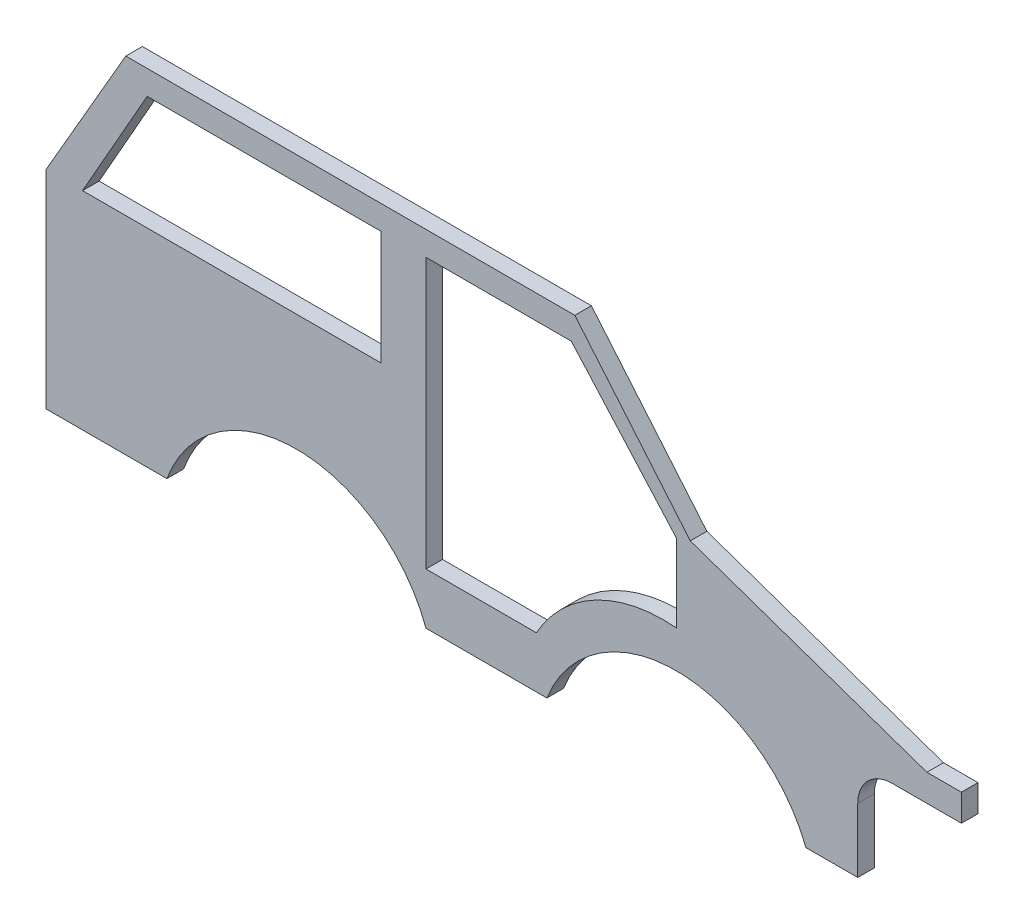
ISO-10303-21;
HEADER;
FILE_DESCRIPTION(('STEP AP214'),'2;1');
FILE_NAME('part.step','',(''),(''),'','','');
FILE_SCHEMA(('AUTOMOTIVE_DESIGN { 1 0 10303 214 1 1 1 1 }'));
ENDSEC;
DATA;
#1=APPLICATION_CONTEXT('core data for automotive mechanical design processes');
#2=APPLICATION_PROTOCOL_DEFINITION('international standard','automotive_design',2000,#1);
#3=PRODUCT_CONTEXT('',#1,'mechanical');
#4=PRODUCT('Part','Part','',(#3));
#5=PRODUCT_RELATED_PRODUCT_CATEGORY('part','',(#4));
#6=PRODUCT_DEFINITION_FORMATION('','',#4);
#7=PRODUCT_DEFINITION_CONTEXT('part definition',#1,'design');
#8=PRODUCT_DEFINITION('design','',#6,#7);
#9=PRODUCT_DEFINITION_SHAPE('','',#8);
#10=(LENGTH_UNIT() NAMED_UNIT(*) SI_UNIT(.MILLI.,.METRE.));
#11=(NAMED_UNIT(*) PLANE_ANGLE_UNIT() SI_UNIT($,.RADIAN.));
#12=(NAMED_UNIT(*) SI_UNIT($,.STERADIAN.) SOLID_ANGLE_UNIT());
#13=UNCERTAINTY_MEASURE_WITH_UNIT(LENGTH_MEASURE(1.E-05),#10,'distance_accuracy_value','');
#14=(GEOMETRIC_REPRESENTATION_CONTEXT(3) GLOBAL_UNCERTAINTY_ASSIGNED_CONTEXT((#13)) GLOBAL_UNIT_ASSIGNED_CONTEXT((#10,
#11,#12)) REPRESENTATION_CONTEXT('',''));
#15=CARTESIAN_POINT('',(0.,0.,0.));
#16=DIRECTION('',(0.,0.,1.));
#17=DIRECTION('',(1.,0.,0.));
#18=AXIS2_PLACEMENT_3D('',#15,#16,#17);
#19=CARTESIAN_POINT('',(55.,0.,4.8));
#20=DIRECTION('',(1.,0.,0.));
#21=DIRECTION('',(0.,1.,0.));
#22=AXIS2_PLACEMENT_3D('',#19,#20,#21);
#23=PLANE('',#22);
#24=DIRECTION('',(0.,-1.,0.));
#25=VECTOR('',#24,1.);
#26=CARTESIAN_POINT('',(55.,0.,0.));
#27=LINE('',#26,#25);
#28=CARTESIAN_POINT('',(55.,58.8607484875032,0.));
#29=VERTEX_POINT('',#28);
#30=CARTESIAN_POINT('',(55.,36.3212557276562,0.));
#31=VERTEX_POINT('',#30);
#32=EDGE_CURVE('E319',#29,#31,#27,.T.);
#33=ORIENTED_EDGE('',*,*,#32,.T.);
#34=DIRECTION('',(0.,0.,-1.));
#35=VECTOR('',#34,1.);
#36=CARTESIAN_POINT('',(55.,36.3212557276562,4.8));
#37=LINE('',#36,#35);
#38=CARTESIAN_POINT('',(55.,36.3212557276562,4.8));
#39=VERTEX_POINT('',#38);
#40=EDGE_CURVE('E11',#39,#31,#37,.T.);
#41=ORIENTED_EDGE('',*,*,#40,.F.);
#42=DIRECTION('',(0.,-1.,0.));
#43=VECTOR('',#42,1.);
#44=CARTESIAN_POINT('',(55.,0.,4.8));
#45=LINE('',#44,#43);
#46=CARTESIAN_POINT('',(55.,58.8607484875032,4.8));
#47=VERTEX_POINT('',#46);
#48=EDGE_CURVE('E489',#47,#39,#45,.T.);
#49=ORIENTED_EDGE('',*,*,#48,.F.);
#50=DIRECTION('',(0.,0.,-1.));
#51=VECTOR('',#50,1.);
#52=CARTESIAN_POINT('',(55.,58.8607484875032,4.8));
#53=LINE('',#52,#51);
#54=EDGE_CURVE('E338',#47,#29,#53,.T.);
#55=ORIENTED_EDGE('',*,*,#54,.T.);
#56=EDGE_LOOP('',(#33,#41,#49,#55));
#57=FACE_BOUND('',#56,.T.);
#58=ADVANCED_FACE('F43',(#57),#23,.F.);
#59=CARTESIAN_POINT('',(51.2398438065162,-5.5727573362113,4.8));
#60=DIRECTION('',(0.,0.,-1.));
#61=DIRECTION('',(-1.,0.,0.));
#62=AXIS2_PLACEMENT_3D('',#59,#60,#61);
#63=CYLINDRICAL_SURFACE('',#62,42.0624191552851);
#64=CARTESIAN_POINT('',(51.2398438065162,-5.5727573362113,0.));
#65=DIRECTION('',(0.,0.,1.));
#66=DIRECTION('',(1.,0.,0.));
#67=AXIS2_PLACEMENT_3D('',#64,#65,#66);
#68=CIRCLE('',#67,42.0624191552851);
#69=CARTESIAN_POINT('',(14.4666978922717,14.8474004683841,0.));
#70=VERTEX_POINT('',#69);
#71=EDGE_CURVE('E323',#31,#70,#68,.T.);
#72=ORIENTED_EDGE('',*,*,#71,.T.);
#73=DIRECTION('',(0.,0.,-1.));
#74=VECTOR('',#73,1.);
#75=CARTESIAN_POINT('',(14.4666978922717,14.8474004683841,4.8));
#76=LINE('',#75,#74);
#77=CARTESIAN_POINT('',(14.4666978922717,14.8474004683841,4.8));
#78=VERTEX_POINT('',#77);
#79=EDGE_CURVE('E54',#78,#70,#76,.T.);
#80=ORIENTED_EDGE('',*,*,#79,.F.);
#81=CARTESIAN_POINT('',(51.2398438065162,-5.5727573362113,4.8));
#82=DIRECTION('',(0.,0.,1.));
#83=DIRECTION('',(1.,0.,0.));
#84=AXIS2_PLACEMENT_3D('',#81,#82,#83);
#85=CIRCLE('',#84,42.0624191552851);
#86=EDGE_CURVE('E246',#39,#78,#85,.T.);
#87=ORIENTED_EDGE('',*,*,#86,.F.);
#88=ORIENTED_EDGE('',*,*,#40,.T.);
#89=EDGE_LOOP('',(#72,#80,#87,#88));
#90=FACE_BOUND('',#89,.T.);
#91=ADVANCED_FACE('F496',(#90),#63,.T.);
#92=CARTESIAN_POINT('',(0.,14.8474004683841,4.8));
#93=DIRECTION('',(0.,1.,0.));
#94=DIRECTION('',(0.,0.,1.));
#95=AXIS2_PLACEMENT_3D('',#92,#93,#94);
#96=PLANE('',#95);
#97=DIRECTION('',(1.,0.,0.));
#98=VECTOR('',#97,1.);
#99=CARTESIAN_POINT('',(0.,14.8474004683841,0.));
#100=LINE('',#99,#98);
#101=CARTESIAN_POINT('',(-17.5,14.8474004683841,0.));
#102=VERTEX_POINT('',#101);
#103=EDGE_CURVE('E327',#102,#70,#100,.T.);
#104=ORIENTED_EDGE('',*,*,#103,.F.);
#105=DIRECTION('',(0.,0.,-1.));
#106=VECTOR('',#105,1.);
#107=CARTESIAN_POINT('',(-17.5,14.8474004683841,4.8));
#108=LINE('',#107,#106);
#109=CARTESIAN_POINT('',(-17.5,14.8474004683841,4.8));
#110=VERTEX_POINT('',#109);
#111=EDGE_CURVE('E232',#110,#102,#108,.T.);
#112=ORIENTED_EDGE('',*,*,#111,.F.);
#113=DIRECTION('',(1.,0.,0.));
#114=VECTOR('',#113,1.);
#115=CARTESIAN_POINT('',(0.,14.8474004683841,4.8));
#116=LINE('',#115,#114);
#117=EDGE_CURVE('E242',#110,#78,#116,.T.);
#118=ORIENTED_EDGE('',*,*,#117,.T.);
#119=ORIENTED_EDGE('',*,*,#79,.T.);
#120=EDGE_LOOP('',(#104,#112,#118,#119));
#121=FACE_BOUND('',#120,.T.);
#122=ADVANCED_FACE('F499',(#121),#96,.T.);
#123=CARTESIAN_POINT('',(-17.5,0.,4.8));
#124=DIRECTION('',(1.,0.,0.));
#125=DIRECTION('',(0.,0.,-1.));
#126=AXIS2_PLACEMENT_3D('',#123,#124,#125);
#127=PLANE('',#126);
#128=DIRECTION('',(0.,-1.,0.));
#129=VECTOR('',#128,1.);
#130=CARTESIAN_POINT('',(-17.5,0.,0.));
#131=LINE('',#130,#129);
#132=CARTESIAN_POINT('',(-17.5,92.9990061253258,0.));
#133=VERTEX_POINT('',#132);
#134=EDGE_CURVE('E230',#133,#102,#131,.T.);
#135=ORIENTED_EDGE('',*,*,#134,.F.);
#136=DIRECTION('',(0.,0.,-1.));
#137=VECTOR('',#136,1.);
#138=CARTESIAN_POINT('',(-17.5,92.9990061253258,4.8));
#139=LINE('',#138,#137);
#140=CARTESIAN_POINT('',(-17.5,92.9990061253258,4.8));
#141=VERTEX_POINT('',#140);
#142=EDGE_CURVE('E224',#141,#133,#139,.T.);
#143=ORIENTED_EDGE('',*,*,#142,.F.);
#144=DIRECTION('',(0.,-1.,0.));
#145=VECTOR('',#144,1.);
#146=CARTESIAN_POINT('',(-17.5,0.,4.8));
#147=LINE('',#146,#145);
#148=EDGE_CURVE('E228',#141,#110,#147,.T.);
#149=ORIENTED_EDGE('',*,*,#148,.T.);
#150=ORIENTED_EDGE('',*,*,#111,.T.);
#151=EDGE_LOOP('',(#135,#143,#149,#150));
#152=FACE_BOUND('',#151,.T.);
#153=ADVANCED_FACE('F226',(#152),#127,.T.);
#154=CARTESIAN_POINT('',(0.,92.9990061253258,4.8));
#155=DIRECTION('',(0.,1.,0.));
#156=DIRECTION('',(0.,0.,1.));
#157=AXIS2_PLACEMENT_3D('',#154,#155,#156);
#158=PLANE('',#157);
#159=DIRECTION('',(1.,0.,0.));
#160=VECTOR('',#159,1.);
#161=CARTESIAN_POINT('',(0.,92.9990061253258,0.));
#162=LINE('',#161,#160);
#163=CARTESIAN_POINT('',(24.5788038979521,92.9990061253258,0.));
#164=VERTEX_POINT('',#163);
#165=EDGE_CURVE('E142',#133,#164,#162,.T.);
#166=ORIENTED_EDGE('',*,*,#165,.T.);
#167=DIRECTION('',(0.,0.,-1.));
#168=VECTOR('',#167,1.);
#169=CARTESIAN_POINT('',(24.5788038979521,92.9990061253258,4.8));
#170=LINE('',#169,#168);
#171=CARTESIAN_POINT('',(24.5788038979521,92.9990061253258,4.8));
#172=VERTEX_POINT('',#171);
#173=EDGE_CURVE('E233',#172,#164,#170,.T.);
#174=ORIENTED_EDGE('',*,*,#173,.F.);
#175=DIRECTION('',(1.,0.,0.));
#176=VECTOR('',#175,1.);
#177=CARTESIAN_POINT('',(0.,92.9990061253258,4.8));
#178=LINE('',#177,#176);
#179=EDGE_CURVE('E235',#141,#172,#178,.T.);
#180=ORIENTED_EDGE('',*,*,#179,.F.);
#181=ORIENTED_EDGE('',*,*,#142,.T.);
#182=EDGE_LOOP('',(#166,#174,#180,#181));
#183=FACE_BOUND('',#182,.T.);
#184=ADVANCED_FACE('F236',(#183),#158,.F.);
#185=CARTESIAN_POINT('',(107.5,0.,4.8));
#186=DIRECTION('',(-1.,0.,0.));
#187=DIRECTION('',(0.,-1.,0.));
#188=AXIS2_PLACEMENT_3D('',#185,#186,#187);
#189=PLANE('',#188);
#190=DIRECTION('',(0.,1.,0.));
#191=VECTOR('',#190,1.);
#192=CARTESIAN_POINT('',(107.5,0.,0.));
#193=LINE('',#192,#191);
#194=CARTESIAN_POINT('',(107.5,0.,0.));
#195=VERTEX_POINT('',#194);
#196=CARTESIAN_POINT('',(107.5,18.5999999999997,0.));
#197=VERTEX_POINT('',#196);
#198=EDGE_CURVE('E266',#195,#197,#193,.T.);
#199=ORIENTED_EDGE('',*,*,#198,.T.);
#200=DIRECTION('',(0.,0.,-1.));
#201=VECTOR('',#200,1.);
#202=CARTESIAN_POINT('',(107.5,18.5999999999997,4.8));
#203=LINE('',#202,#201);
#204=CARTESIAN_POINT('',(107.5,18.5999999999997,4.8));
#205=VERTEX_POINT('',#204);
#206=EDGE_CURVE('E341',#205,#197,#203,.T.);
#207=ORIENTED_EDGE('',*,*,#206,.F.);
#208=DIRECTION('',(0.,1.,0.));
#209=VECTOR('',#208,1.);
#210=CARTESIAN_POINT('',(107.5,0.,4.8));
#211=LINE('',#210,#209);
#212=CARTESIAN_POINT('',(107.5,0.,4.8));
#213=VERTEX_POINT('',#212);
#214=EDGE_CURVE('E431',#213,#205,#211,.T.);
#215=ORIENTED_EDGE('',*,*,#214,.F.);
#216=DIRECTION('',(0.,0.,-1.));
#217=VECTOR('',#216,1.);
#218=CARTESIAN_POINT('',(107.5,0.,4.8));
#219=LINE('',#218,#217);
#220=EDGE_CURVE('E348',#213,#195,#219,.T.);
#221=ORIENTED_EDGE('',*,*,#220,.T.);
#222=EDGE_LOOP('',(#199,#207,#215,#221));
#223=FACE_BOUND('',#222,.T.);
#224=ADVANCED_FACE('F577',(#223),#189,.F.);
#225=CARTESIAN_POINT('',(117.5,18.5999999999997,4.8));
#226=DIRECTION('',(0.,0.,-1.));
#227=DIRECTION('',(-1.,0.,0.));
#228=AXIS2_PLACEMENT_3D('',#225,#226,#227);
#229=CYLINDRICAL_SURFACE('',#228,10.);
#230=CARTESIAN_POINT('',(117.5,18.5999999999997,0.));
#231=DIRECTION('',(0.,0.,1.));
#232=DIRECTION('',(1.,0.,0.));
#233=AXIS2_PLACEMENT_3D('',#230,#231,#232);
#234=CIRCLE('',#233,10.);
#235=CARTESIAN_POINT('',(117.5,28.5999999999997,0.));
#236=VERTEX_POINT('',#235);
#237=EDGE_CURVE('E270',#197,#236,#234,.F.);
#238=ORIENTED_EDGE('',*,*,#237,.T.);
#239=DIRECTION('',(0.,0.,-1.));
#240=VECTOR('',#239,1.);
#241=CARTESIAN_POINT('',(117.5,28.5999999999997,4.8));
#242=LINE('',#241,#240);
#243=CARTESIAN_POINT('',(117.5,28.5999999999997,4.8));
#244=VERTEX_POINT('',#243);
#245=EDGE_CURVE('E393',#244,#236,#242,.T.);
#246=ORIENTED_EDGE('',*,*,#245,.F.);
#247=CARTESIAN_POINT('',(117.5,18.5999999999997,4.8));
#248=DIRECTION('',(0.,0.,1.));
#249=DIRECTION('',(1.,0.,0.));
#250=AXIS2_PLACEMENT_3D('',#247,#248,#249);
#251=CIRCLE('',#250,10.);
#252=EDGE_CURVE('E437',#205,#244,#251,.F.);
#253=ORIENTED_EDGE('',*,*,#252,.F.);
#254=ORIENTED_EDGE('',*,*,#206,.T.);
#255=EDGE_LOOP('',(#238,#246,#253,#254));
#256=FACE_BOUND('',#255,.T.);
#257=ADVANCED_FACE('F573',(#256),#229,.F.);
#258=CARTESIAN_POINT('',(1.64607903631864E-12,28.6000000000065,4.8));
#259=DIRECTION('',(0.,1.,0.));
#260=DIRECTION('',(-1.,0.,0.));
#261=AXIS2_PLACEMENT_3D('',#258,#259,#260);
#262=PLANE('',#261);
#263=DIRECTION('',(1.,0.,0.));
#264=VECTOR('',#263,1.);
#265=CARTESIAN_POINT('',(1.64607903631864E-12,28.6000000000065,0.));
#266=LINE('',#265,#264);
#267=CARTESIAN_POINT('',(137.513068614173,28.5999999999986,0.));
#268=VERTEX_POINT('',#267);
#269=EDGE_CURVE('E273',#236,#268,#266,.T.);
#270=ORIENTED_EDGE('',*,*,#269,.T.);
#271=DIRECTION('',(0.,0.,-1.));
#272=VECTOR('',#271,1.);
#273=CARTESIAN_POINT('',(137.513068614173,28.5999999999986,4.8));
#274=LINE('',#273,#272);
#275=CARTESIAN_POINT('',(137.513068614173,28.5999999999986,4.8));
#276=VERTEX_POINT('',#275);
#277=EDGE_CURVE('E389',#276,#268,#274,.T.);
#278=ORIENTED_EDGE('',*,*,#277,.F.);
#279=DIRECTION('',(1.,0.,0.));
#280=VECTOR('',#279,1.);
#281=CARTESIAN_POINT('',(1.64607903631864E-12,28.6000000000065,4.8));
#282=LINE('',#281,#280);
#283=EDGE_CURVE('E444',#244,#276,#282,.T.);
#284=ORIENTED_EDGE('',*,*,#283,.F.);
#285=ORIENTED_EDGE('',*,*,#245,.T.);
#286=EDGE_LOOP('',(#270,#278,#284,#285));
#287=FACE_BOUND('',#286,.T.);
#288=ADVANCED_FACE('F569',(#287),#262,.F.);
#289=CARTESIAN_POINT('',(137.513068614173,0.,4.8));
#290=DIRECTION('',(-1.,0.,0.));
#291=DIRECTION('',(0.,0.,1.));
#292=AXIS2_PLACEMENT_3D('',#289,#290,#291);
#293=PLANE('',#292);
#294=DIRECTION('',(0.,1.,0.));
#295=VECTOR('',#294,1.);
#296=CARTESIAN_POINT('',(137.513068614173,0.,0.));
#297=LINE('',#296,#295);
#298=CARTESIAN_POINT('',(137.513068614173,36.3999999999985,0.));
#299=VERTEX_POINT('',#298);
#300=EDGE_CURVE('E276',#268,#299,#297,.T.);
#301=ORIENTED_EDGE('',*,*,#300,.T.);
#302=DIRECTION('',(0.,0.,-1.));
#303=VECTOR('',#302,1.);
#304=CARTESIAN_POINT('',(137.513068614173,36.3999999999985,4.8));
#305=LINE('',#304,#303);
#306=CARTESIAN_POINT('',(137.513068614173,36.3999999999985,4.8));
#307=VERTEX_POINT('',#306);
#308=EDGE_CURVE('E385',#307,#299,#305,.T.);
#309=ORIENTED_EDGE('',*,*,#308,.F.);
#310=DIRECTION('',(0.,1.,0.));
#311=VECTOR('',#310,1.);
#312=CARTESIAN_POINT('',(137.513068614173,0.,4.8));
#313=LINE('',#312,#311);
#314=EDGE_CURVE('E447',#276,#307,#313,.T.);
#315=ORIENTED_EDGE('',*,*,#314,.F.);
#316=ORIENTED_EDGE('',*,*,#277,.T.);
#317=EDGE_LOOP('',(#301,#309,#315,#316));
#318=FACE_BOUND('',#317,.T.);
#319=ADVANCED_FACE('F565',(#318),#293,.F.);
#320=CARTESIAN_POINT('',(0.,36.3999999999985,4.8));
#321=DIRECTION('',(0.,-1.,0.));
#322=DIRECTION('',(0.,0.,-1.));
#323=AXIS2_PLACEMENT_3D('',#320,#321,#322);
#324=PLANE('',#323);
#325=DIRECTION('',(-1.,0.,0.));
#326=VECTOR('',#325,1.);
#327=CARTESIAN_POINT('',(0.,36.3999999999985,0.));
#328=LINE('',#327,#326);
#329=CARTESIAN_POINT('',(127.513068614173,36.3999999999986,0.));
#330=VERTEX_POINT('',#329);
#331=EDGE_CURVE('E279',#299,#330,#328,.T.);
#332=ORIENTED_EDGE('',*,*,#331,.T.);
#333=DIRECTION('',(0.,0.,-1.));
#334=VECTOR('',#333,1.);
#335=CARTESIAN_POINT('',(127.513068614173,36.3999999999986,4.8));
#336=LINE('',#335,#334);
#337=CARTESIAN_POINT('',(127.513068614173,36.3999999999986,4.8));
#338=VERTEX_POINT('',#337);
#339=EDGE_CURVE('E382',#338,#330,#336,.T.);
#340=ORIENTED_EDGE('',*,*,#339,.F.);
#341=DIRECTION('',(-1.,0.,0.));
#342=VECTOR('',#341,1.);
#343=CARTESIAN_POINT('',(0.,36.3999999999985,4.8));
#344=LINE('',#343,#342);
#345=EDGE_CURVE('E450',#307,#338,#344,.T.);
#346=ORIENTED_EDGE('',*,*,#345,.F.);
#347=ORIENTED_EDGE('',*,*,#308,.T.);
#348=EDGE_LOOP('',(#332,#340,#346,#347));
#349=FACE_BOUND('',#348,.T.);
#350=ADVANCED_FACE('F561',(#349),#324,.F.);
#351=CARTESIAN_POINT('',(24.9745853837457,71.9782121733141,4.8));
#352=DIRECTION('',(0.327802606314683,0.944746236453631,0.));
#353=DIRECTION('',(-0.944746236453632,0.327802606314683,0.));
#354=AXIS2_PLACEMENT_3D('',#351,#352,#353);
#355=PLANE('',#354);
#356=DIRECTION('',(0.944746236453632,-0.327802606314683,0.));
#357=VECTOR('',#356,1.);
#358=CARTESIAN_POINT('',(24.9745853837457,71.9782121733141,0.));
#359=LINE('',#358,#357);
#360=CARTESIAN_POINT('',(59.0189664712851,60.1656889578131,0.));
#361=VERTEX_POINT('',#360);
#362=EDGE_CURVE('E283',#361,#330,#359,.T.);
#363=ORIENTED_EDGE('',*,*,#362,.F.);
#364=DIRECTION('',(0.,0.,-1.));
#365=VECTOR('',#364,1.);
#366=CARTESIAN_POINT('',(59.0189664712851,60.1656889578131,4.8));
#367=LINE('',#366,#365);
#368=CARTESIAN_POINT('',(59.0189664712851,60.1656889578131,4.8));
#369=VERTEX_POINT('',#368);
#370=EDGE_CURVE('E379',#369,#361,#367,.T.);
#371=ORIENTED_EDGE('',*,*,#370,.F.);
#372=DIRECTION('',(0.944746236453632,-0.327802606314683,0.));
#373=VECTOR('',#372,1.);
#374=CARTESIAN_POINT('',(24.9745853837457,71.9782121733141,4.8));
#375=LINE('',#374,#373);
#376=EDGE_CURVE('E453',#369,#338,#375,.T.);
#377=ORIENTED_EDGE('',*,*,#376,.T.);
#378=ORIENTED_EDGE('',*,*,#339,.T.);
#379=EDGE_LOOP('',(#363,#371,#377,#378));
#380=FACE_BOUND('',#379,.T.);
#381=ADVANCED_FACE('F557',(#380),#355,.T.);
#382=CARTESIAN_POINT('',(64.2595696988924,53.9201812339512,4.8));
#383=DIRECTION('',(0.766044443118979,0.642787609686538,0.));
#384=DIRECTION('',(-0.642787609686538,0.766044443118979,0.));
#385=AXIS2_PLACEMENT_3D('',#382,#383,#384);
#386=PLANE('',#385);
#387=DIRECTION('',(0.642787609686538,-0.766044443118979,0.));
#388=VECTOR('',#387,1.);
#389=CARTESIAN_POINT('',(64.2595696988924,53.9201812339512,0.));
#390=LINE('',#389,#388);
#391=CARTESIAN_POINT('',(25.5940107675851,100.,0.));
#392=VERTEX_POINT('',#391);
#393=EDGE_CURVE('E287',#392,#361,#390,.T.);
#394=ORIENTED_EDGE('',*,*,#393,.F.);
#395=DIRECTION('',(0.,0.,-1.));
#396=VECTOR('',#395,1.);
#397=CARTESIAN_POINT('',(25.5940107675851,100.,4.8));
#398=LINE('',#397,#396);
#399=CARTESIAN_POINT('',(25.5940107675851,100.,4.8));
#400=VERTEX_POINT('',#399);
#401=EDGE_CURVE('E376',#400,#392,#398,.T.);
#402=ORIENTED_EDGE('',*,*,#401,.F.);
#403=DIRECTION('',(0.642787609686538,-0.766044443118979,0.));
#404=VECTOR('',#403,1.);
#405=CARTESIAN_POINT('',(64.2595696988924,53.9201812339512,4.8));
#406=LINE('',#405,#404);
#407=EDGE_CURVE('E457',#400,#369,#406,.T.);
#408=ORIENTED_EDGE('',*,*,#407,.T.);
#409=ORIENTED_EDGE('',*,*,#370,.T.);
#410=EDGE_LOOP('',(#394,#402,#408,#409));
#411=FACE_BOUND('',#410,.T.);
#412=ADVANCED_FACE('F553',(#411),#386,.T.);
#413=CARTESIAN_POINT('',(0.,100.,4.8));
#414=DIRECTION('',(0.,1.,0.));
#415=DIRECTION('',(-1.,0.,0.));
#416=AXIS2_PLACEMENT_3D('',#413,#414,#415);
#417=PLANE('',#416);
#418=DIRECTION('',(1.,0.,0.));
#419=VECTOR('',#418,1.);
#420=CARTESIAN_POINT('',(0.,100.,0.));
#421=LINE('',#420,#419);
#422=CARTESIAN_POINT('',(-104.405989232415,100.,0.));
#423=VERTEX_POINT('',#422);
#424=EDGE_CURVE('E291',#423,#392,#421,.T.);
#425=ORIENTED_EDGE('',*,*,#424,.F.);
#426=DIRECTION('',(0.,0.,-1.));
#427=VECTOR('',#426,1.);
#428=CARTESIAN_POINT('',(-104.405989232415,100.,4.8));
#429=LINE('',#428,#427);
#430=CARTESIAN_POINT('',(-104.405989232415,100.,4.8));
#431=VERTEX_POINT('',#430);
#432=EDGE_CURVE('E373',#431,#423,#429,.T.);
#433=ORIENTED_EDGE('',*,*,#432,.F.);
#434=DIRECTION('',(1.,0.,0.));
#435=VECTOR('',#434,1.);
#436=CARTESIAN_POINT('',(0.,100.,4.8));
#437=LINE('',#436,#435);
#438=EDGE_CURVE('E461',#431,#400,#437,.T.);
#439=ORIENTED_EDGE('',*,*,#438,.T.);
#440=ORIENTED_EDGE('',*,*,#401,.T.);
#441=EDGE_LOOP('',(#425,#433,#439,#440));
#442=FACE_BOUND('',#441,.T.);
#443=ADVANCED_FACE('F549',(#442),#417,.T.);
#444=CARTESIAN_POINT('',(-121.605762113533,70.2091194912581,4.8));
#445=DIRECTION('',(-0.866025403784438,0.500000000000001,0.));
#446=DIRECTION('',(-0.500000000000001,-0.866025403784438,0.));
#447=AXIS2_PLACEMENT_3D('',#444,#445,#446);
#448=PLANE('',#447);
#449=DIRECTION('',(0.500000000000001,0.866025403784438,0.));
#450=VECTOR('',#449,1.);
#451=CARTESIAN_POINT('',(-121.605762113533,70.2091194912581,0.));
#452=LINE('',#451,#450);
#453=CARTESIAN_POINT('',(-127.5,60.,0.));
#454=VERTEX_POINT('',#453);
#455=EDGE_CURVE('E295',#454,#423,#452,.T.);
#456=ORIENTED_EDGE('',*,*,#455,.F.);
#457=DIRECTION('',(0.,0.,-1.));
#458=VECTOR('',#457,1.);
#459=CARTESIAN_POINT('',(-127.5,60.,4.8));
#460=LINE('',#459,#458);
#461=CARTESIAN_POINT('',(-127.5,60.,4.8));
#462=VERTEX_POINT('',#461);
#463=EDGE_CURVE('E370',#462,#454,#460,.T.);
#464=ORIENTED_EDGE('',*,*,#463,.F.);
#465=DIRECTION('',(0.500000000000001,0.866025403784438,0.));
#466=VECTOR('',#465,1.);
#467=CARTESIAN_POINT('',(-121.605762113533,70.2091194912581,4.8));
#468=LINE('',#467,#466);
#469=EDGE_CURVE('E465',#462,#431,#468,.T.);
#470=ORIENTED_EDGE('',*,*,#469,.T.);
#471=ORIENTED_EDGE('',*,*,#432,.T.);
#472=EDGE_LOOP('',(#456,#464,#470,#471));
#473=FACE_BOUND('',#472,.T.);
#474=ADVANCED_FACE('F545',(#473),#448,.T.);
#475=CARTESIAN_POINT('',(-127.5,0.,4.8));
#476=DIRECTION('',(-1.,0.,0.));
#477=DIRECTION('',(0.,0.,1.));
#478=AXIS2_PLACEMENT_3D('',#475,#476,#477);
#479=PLANE('',#478);
#480=DIRECTION('',(0.,1.,0.));
#481=VECTOR('',#480,1.);
#482=CARTESIAN_POINT('',(-127.5,0.,0.));
#483=LINE('',#482,#481);
#484=CARTESIAN_POINT('',(-127.5,0.,0.));
#485=VERTEX_POINT('',#484);
#486=EDGE_CURVE('E299',#485,#454,#483,.T.);
#487=ORIENTED_EDGE('',*,*,#486,.F.);
#488=DIRECTION('',(0.,0.,-1.));
#489=VECTOR('',#488,1.);
#490=CARTESIAN_POINT('',(-127.5,0.,4.8));
#491=LINE('',#490,#489);
#492=CARTESIAN_POINT('',(-127.5,0.,4.8));
#493=VERTEX_POINT('',#492);
#494=EDGE_CURVE('E367',#493,#485,#491,.T.);
#495=ORIENTED_EDGE('',*,*,#494,.F.);
#496=DIRECTION('',(0.,1.,0.));
#497=VECTOR('',#496,1.);
#498=CARTESIAN_POINT('',(-127.5,0.,4.8));
#499=LINE('',#498,#497);
#500=EDGE_CURVE('E469',#493,#462,#499,.T.);
#501=ORIENTED_EDGE('',*,*,#500,.T.);
#502=ORIENTED_EDGE('',*,*,#463,.T.);
#503=EDGE_LOOP('',(#487,#495,#501,#502));
#504=FACE_BOUND('',#503,.T.);
#505=ADVANCED_FACE('F541',(#504),#479,.T.);
#506=CARTESIAN_POINT('',(0.,0.,4.8));
#507=DIRECTION('',(0.,-1.,0.));
#508=DIRECTION('',(1.,0.,0.));
#509=AXIS2_PLACEMENT_3D('',#506,#507,#508);
#510=PLANE('',#509);
#511=DIRECTION('',(-1.,0.,0.));
#512=VECTOR('',#511,1.);
#513=CARTESIAN_POINT('',(0.,0.,0.));
#514=LINE('',#513,#512);
#515=CARTESIAN_POINT('',(-92.5,0.,0.));
#516=VERTEX_POINT('',#515);
#517=EDGE_CURVE('E303',#516,#485,#514,.T.);
#518=ORIENTED_EDGE('',*,*,#517,.F.);
#519=DIRECTION('',(0.,0.,-1.));
#520=VECTOR('',#519,1.);
#521=CARTESIAN_POINT('',(-92.5,0.,4.8));
#522=LINE('',#521,#520);
#523=CARTESIAN_POINT('',(-92.5,0.,4.8));
#524=VERTEX_POINT('',#523);
#525=EDGE_CURVE('E364',#524,#516,#522,.T.);
#526=ORIENTED_EDGE('',*,*,#525,.F.);
#527=DIRECTION('',(-1.,0.,0.));
#528=VECTOR('',#527,1.);
#529=CARTESIAN_POINT('',(0.,0.,4.8));
#530=LINE('',#529,#528);
#531=EDGE_CURVE('E473',#524,#493,#530,.T.);
#532=ORIENTED_EDGE('',*,*,#531,.T.);
#533=ORIENTED_EDGE('',*,*,#494,.T.);
#534=EDGE_LOOP('',(#518,#526,#532,#533));
#535=FACE_BOUND('',#534,.T.);
#536=ADVANCED_FACE('F537',(#535),#510,.T.);
#537=CARTESIAN_POINT('',(-55.,-13.7733669493003,4.8));
#538=DIRECTION('',(0.,0.,-1.));
#539=DIRECTION('',(-1.,0.,0.));
#540=AXIS2_PLACEMENT_3D('',#537,#538,#539);
#541=CYLINDRICAL_SURFACE('',#540,39.9494134765465);
#542=CARTESIAN_POINT('',(-55.,-13.7733669493003,0.));
#543=DIRECTION('',(0.,0.,1.));
#544=DIRECTION('',(1.,0.,0.));
#545=AXIS2_PLACEMENT_3D('',#542,#543,#544);
#546=CIRCLE('',#545,39.9494134765465);
#547=CARTESIAN_POINT('',(-17.5,0.,0.));
#548=VERTEX_POINT('',#547);
#549=EDGE_CURVE('E307',#516,#548,#546,.F.);
#550=ORIENTED_EDGE('',*,*,#549,.T.);
#551=DIRECTION('',(0.,0.,-1.));
#552=VECTOR('',#551,1.);
#553=CARTESIAN_POINT('',(-17.5,0.,4.8));
#554=LINE('',#553,#552);
#555=CARTESIAN_POINT('',(-17.5,0.,4.8));
#556=VERTEX_POINT('',#555);
#557=EDGE_CURVE('E360',#556,#548,#554,.T.);
#558=ORIENTED_EDGE('',*,*,#557,.F.);
#559=CARTESIAN_POINT('',(-55.,-13.7733669493003,4.8));
#560=DIRECTION('',(0.,0.,1.));
#561=DIRECTION('',(1.,0.,0.));
#562=AXIS2_PLACEMENT_3D('',#559,#560,#561);
#563=CIRCLE('',#562,39.9494134765465);
#564=EDGE_CURVE('E477',#524,#556,#563,.F.);
#565=ORIENTED_EDGE('',*,*,#564,.F.);
#566=ORIENTED_EDGE('',*,*,#525,.T.);
#567=EDGE_LOOP('',(#550,#558,#565,#566));
#568=FACE_BOUND('',#567,.T.);
#569=ADVANCED_FACE('F533',(#568),#541,.F.);
#570=CARTESIAN_POINT('',(0.,0.,4.8));
#571=DIRECTION('',(0.,1.,0.));
#572=DIRECTION('',(-1.,0.,0.));
#573=AXIS2_PLACEMENT_3D('',#570,#571,#572);
#574=PLANE('',#573);
#575=DIRECTION('',(1.,0.,0.));
#576=VECTOR('',#575,1.);
#577=CARTESIAN_POINT('',(0.,0.,0.));
#578=LINE('',#577,#576);
#579=CARTESIAN_POINT('',(17.5,0.,0.));
#580=VERTEX_POINT('',#579);
#581=EDGE_CURVE('E310',#548,#580,#578,.T.);
#582=ORIENTED_EDGE('',*,*,#581,.T.);
#583=DIRECTION('',(0.,0.,-1.));
#584=VECTOR('',#583,1.);
#585=CARTESIAN_POINT('',(17.5,0.,4.8));
#586=LINE('',#585,#584);
#587=CARTESIAN_POINT('',(17.5,0.,4.8));
#588=VERTEX_POINT('',#587);
#589=EDGE_CURVE('E356',#588,#580,#586,.T.);
#590=ORIENTED_EDGE('',*,*,#589,.F.);
#591=DIRECTION('',(1.,0.,0.));
#592=VECTOR('',#591,1.);
#593=CARTESIAN_POINT('',(0.,0.,4.8));
#594=LINE('',#593,#592);
#595=EDGE_CURVE('E480',#556,#588,#594,.T.);
#596=ORIENTED_EDGE('',*,*,#595,.F.);
#597=ORIENTED_EDGE('',*,*,#557,.T.);
#598=EDGE_LOOP('',(#582,#590,#596,#597));
#599=FACE_BOUND('',#598,.T.);
#600=ADVANCED_FACE('F529',(#599),#574,.F.);
#601=CARTESIAN_POINT('',(55.,-14.6968495468267,4.8));
#602=DIRECTION('',(0.,0.,-1.));
#603=DIRECTION('',(-1.,0.,0.));
#604=AXIS2_PLACEMENT_3D('',#601,#602,#603);
#605=CYLINDRICAL_SURFACE('',#604,40.2771323036045);
#606=CARTESIAN_POINT('',(55.,-14.6968495468267,0.));
#607=DIRECTION('',(0.,0.,1.));
#608=DIRECTION('',(1.,0.,0.));
#609=AXIS2_PLACEMENT_3D('',#606,#607,#608);
#610=CIRCLE('',#609,40.2771323036045);
#611=CARTESIAN_POINT('',(92.5,0.,0.));
#612=VERTEX_POINT('',#611);
#613=EDGE_CURVE('E313',#580,#612,#610,.F.);
#614=ORIENTED_EDGE('',*,*,#613,.T.);
#615=DIRECTION('',(0.,0.,-1.));
#616=VECTOR('',#615,1.);
#617=CARTESIAN_POINT('',(92.5,0.,4.8));
#618=LINE('',#617,#616);
#619=CARTESIAN_POINT('',(92.5,0.,4.8));
#620=VERTEX_POINT('',#619);
#621=EDGE_CURVE('E352',#620,#612,#618,.T.);
#622=ORIENTED_EDGE('',*,*,#621,.F.);
#623=CARTESIAN_POINT('',(55.,-14.6968495468267,4.8));
#624=DIRECTION('',(0.,0.,1.));
#625=DIRECTION('',(1.,0.,0.));
#626=AXIS2_PLACEMENT_3D('',#623,#624,#625);
#627=CIRCLE('',#626,40.2771323036045);
#628=EDGE_CURVE('E483',#588,#620,#627,.F.);
#629=ORIENTED_EDGE('',*,*,#628,.F.);
#630=ORIENTED_EDGE('',*,*,#589,.T.);
#631=EDGE_LOOP('',(#614,#622,#629,#630));
#632=FACE_BOUND('',#631,.T.);
#633=ADVANCED_FACE('F526',(#632),#605,.F.);
#634=CARTESIAN_POINT('',(-30.4888781853855,0.,4.8));
#635=DIRECTION('',(1.,0.,0.));
#636=DIRECTION('',(0.,1.,0.));
#637=AXIS2_PLACEMENT_3D('',#634,#635,#636);
#638=PLANE('',#637);
#639=DIRECTION('',(0.,-1.,0.));
#640=VECTOR('',#639,1.);
#641=CARTESIAN_POINT('',(-30.4888781853855,0.,0.));
#642=LINE('',#641,#640);
#643=CARTESIAN_POINT('',(-30.4888781853855,92.9990061253258,0.));
#644=VERTEX_POINT('',#643);
#645=CARTESIAN_POINT('',(-30.4888781853855,60.,0.));
#646=VERTEX_POINT('',#645);
#647=EDGE_CURVE('E253',#644,#646,#642,.T.);
#648=ORIENTED_EDGE('',*,*,#647,.T.);
#649=DIRECTION('',(0.,0.,-1.));
#650=VECTOR('',#649,1.);
#651=CARTESIAN_POINT('',(-30.4888781853855,60.,4.8));
#652=LINE('',#651,#650);
#653=CARTESIAN_POINT('',(-30.4888781853855,60.,4.8));
#654=VERTEX_POINT('',#653);
#655=EDGE_CURVE('E47',#654,#646,#652,.T.);
#656=ORIENTED_EDGE('',*,*,#655,.F.);
#657=DIRECTION('',(0.,-1.,0.));
#658=VECTOR('',#657,1.);
#659=CARTESIAN_POINT('',(-30.4888781853855,0.,4.8));
#660=LINE('',#659,#658);
#661=CARTESIAN_POINT('',(-30.4888781853855,92.9990061253258,4.8));
#662=VERTEX_POINT('',#661);
#663=EDGE_CURVE('E337',#662,#654,#660,.T.);
#664=ORIENTED_EDGE('',*,*,#663,.F.);
#665=DIRECTION('',(0.,0.,-1.));
#666=VECTOR('',#665,1.);
#667=CARTESIAN_POINT('',(-30.4888781853855,92.9990061253258,4.8));
#668=LINE('',#667,#666);
#669=EDGE_CURVE('E252',#662,#644,#668,.T.);
#670=ORIENTED_EDGE('',*,*,#669,.T.);
#671=EDGE_LOOP('',(#648,#656,#664,#670));
#672=FACE_BOUND('',#671,.T.);
#673=ADVANCED_FACE('F45',(#672),#638,.F.);
#674=CARTESIAN_POINT('',(0.,60.,4.8));
#675=DIRECTION('',(0.,-1.,0.));
#676=DIRECTION('',(1.,0.,0.));
#677=AXIS2_PLACEMENT_3D('',#674,#675,#676);
#678=PLANE('',#677);
#679=DIRECTION('',(-1.,0.,0.));
#680=VECTOR('',#679,1.);
#681=CARTESIAN_POINT('',(0.,60.,0.));
#682=LINE('',#681,#680);
#683=CARTESIAN_POINT('',(-116.916975086961,60.,0.));
#684=VERTEX_POINT('',#683);
#685=EDGE_CURVE('E257',#646,#684,#682,.T.);
#686=ORIENTED_EDGE('',*,*,#685,.T.);
#687=DIRECTION('',(0.,0.,-1.));
#688=VECTOR('',#687,1.);
#689=CARTESIAN_POINT('',(-116.916975086961,60.,4.8));
#690=LINE('',#689,#688);
#691=CARTESIAN_POINT('',(-116.916975086961,60.,4.8));
#692=VERTEX_POINT('',#691);
#693=EDGE_CURVE('E406',#692,#684,#690,.T.);
#694=ORIENTED_EDGE('',*,*,#693,.F.);
#695=DIRECTION('',(-1.,0.,0.));
#696=VECTOR('',#695,1.);
#697=CARTESIAN_POINT('',(0.,60.,4.8));
#698=LINE('',#697,#696);
#699=EDGE_CURVE('E157',#654,#692,#698,.T.);
#700=ORIENTED_EDGE('',*,*,#699,.F.);
#701=ORIENTED_EDGE('',*,*,#655,.T.);
#702=EDGE_LOOP('',(#686,#694,#700,#701));
#703=FACE_BOUND('',#702,.T.);
#704=ADVANCED_FACE('F414',(#703),#678,.F.);
#705=CARTESIAN_POINT('',(-114.216075580532,64.7632872749644,4.8));
#706=DIRECTION('',(-0.869888722659849,0.493248020968374,0.));
#707=DIRECTION('',(-0.493248020968374,-0.869888722659849,0.));
#708=AXIS2_PLACEMENT_3D('',#705,#706,#707);
#709=PLANE('',#708);
#710=DIRECTION('',(0.493248020968374,0.869888722659849,0.));
#711=VECTOR('',#710,1.);
#712=CARTESIAN_POINT('',(-114.216075580532,64.7632872749644,0.));
#713=LINE('',#712,#711);
#714=CARTESIAN_POINT('',(-98.205737613424,92.9990061253258,0.));
#715=VERTEX_POINT('',#714);
#716=EDGE_CURVE('E260',#684,#715,#713,.T.);
#717=ORIENTED_EDGE('',*,*,#716,.T.);
#718=DIRECTION('',(0.,0.,-1.));
#719=VECTOR('',#718,1.);
#720=CARTESIAN_POINT('',(-98.205737613424,92.9990061253258,4.8));
#721=LINE('',#720,#719);
#722=CARTESIAN_POINT('',(-98.205737613424,92.9990061253258,4.8));
#723=VERTEX_POINT('',#722);
#724=EDGE_CURVE('E403',#723,#715,#721,.T.);
#725=ORIENTED_EDGE('',*,*,#724,.F.);
#726=DIRECTION('',(0.493248020968374,0.869888722659849,0.));
#727=VECTOR('',#726,1.);
#728=CARTESIAN_POINT('',(-114.216075580532,64.7632872749644,4.8));
#729=LINE('',#728,#727);
#730=EDGE_CURVE('E432',#692,#723,#729,.T.);
#731=ORIENTED_EDGE('',*,*,#730,.F.);
#732=ORIENTED_EDGE('',*,*,#693,.T.);
#733=EDGE_LOOP('',(#717,#725,#731,#732));
#734=FACE_BOUND('',#733,.T.);
#735=ADVANCED_FACE('F424',(#734),#709,.F.);
#736=CARTESIAN_POINT('',(0.,0.,4.8));
#737=DIRECTION('',(0.,1.,0.));
#738=DIRECTION('',(0.,0.,1.));
#739=AXIS2_PLACEMENT_3D('',#736,#737,#738);
#740=PLANE('',#739);
#741=DIRECTION('',(1.,0.,0.));
#742=VECTOR('',#741,1.);
#743=CARTESIAN_POINT('',(0.,0.,0.));
#744=LINE('',#743,#742);
#745=EDGE_CURVE('E316',#612,#195,#744,.T.);
#746=ORIENTED_EDGE('',*,*,#745,.T.);
#747=ORIENTED_EDGE('',*,*,#220,.F.);
#748=DIRECTION('',(1.,0.,0.));
#749=VECTOR('',#748,1.);
#750=CARTESIAN_POINT('',(0.,0.,4.8));
#751=LINE('',#750,#749);
#752=EDGE_CURVE('E486',#620,#213,#751,.T.);
#753=ORIENTED_EDGE('',*,*,#752,.F.);
#754=ORIENTED_EDGE('',*,*,#621,.T.);
#755=EDGE_LOOP('',(#746,#747,#753,#754));
#756=FACE_BOUND('',#755,.T.);
#757=ADVANCED_FACE('F511',(#756),#740,.F.);
#758=CARTESIAN_POINT('',(0.,92.9990061253258,4.8));
#759=DIRECTION('',(0.,1.,0.));
#760=DIRECTION('',(0.,0.,1.));
#761=AXIS2_PLACEMENT_3D('',#758,#759,#760);
#762=PLANE('',#761);
#763=DIRECTION('',(1.,0.,0.));
#764=VECTOR('',#763,1.);
#765=CARTESIAN_POINT('',(0.,92.9990061253258,0.));
#766=LINE('',#765,#764);
#767=EDGE_CURVE('E263',#715,#644,#766,.T.);
#768=ORIENTED_EDGE('',*,*,#767,.T.);
#769=ORIENTED_EDGE('',*,*,#669,.F.);
#770=DIRECTION('',(1.,0.,0.));
#771=VECTOR('',#770,1.);
#772=CARTESIAN_POINT('',(0.,92.9990061253258,4.8));
#773=LINE('',#772,#771);
#774=EDGE_CURVE('E428',#723,#662,#773,.T.);
#775=ORIENTED_EDGE('',*,*,#774,.F.);
#776=ORIENTED_EDGE('',*,*,#724,.T.);
#777=EDGE_LOOP('',(#768,#769,#775,#776));
#778=FACE_BOUND('',#777,.T.);
#779=ADVANCED_FACE('F427',(#778),#762,.F.);
#780=CARTESIAN_POINT('',(59.8921029267303,53.3708962955238,4.8));
#781=DIRECTION('',(0.746582586369056,0.665292748893667,0.));
#782=DIRECTION('',(-0.665292748893667,0.746582586369056,0.));
#783=AXIS2_PLACEMENT_3D('',#780,#781,#782);
#784=PLANE('',#783);
#785=DIRECTION('',(0.665292748893667,-0.746582586369056,0.));
#786=VECTOR('',#785,1.);
#787=CARTESIAN_POINT('',(59.8921029267303,53.3708962955238,0.));
#788=LINE('',#787,#786);
#789=EDGE_CURVE('E148',#164,#29,#788,.T.);
#790=ORIENTED_EDGE('',*,*,#789,.T.);
#791=ORIENTED_EDGE('',*,*,#54,.F.);
#792=DIRECTION('',(0.665292748893667,-0.746582586369056,0.));
#793=VECTOR('',#792,1.);
#794=CARTESIAN_POINT('',(59.8921029267303,53.3708962955238,4.8));
#795=LINE('',#794,#793);
#796=EDGE_CURVE('E63',#172,#47,#795,.T.);
#797=ORIENTED_EDGE('',*,*,#796,.F.);
#798=ORIENTED_EDGE('',*,*,#173,.T.);
#799=EDGE_LOOP('',(#790,#791,#797,#798));
#800=FACE_BOUND('',#799,.T.);
#801=ADVANCED_FACE('F503',(#800),#784,.F.);
#802=CARTESIAN_POINT('',(0.,0.,4.8));
#803=DIRECTION('',(0.,0.,1.));
#804=DIRECTION('',(1.,0.,0.));
#805=AXIS2_PLACEMENT_3D('',#802,#803,#804);
#806=PLANE('',#805);
#807=ORIENTED_EDGE('',*,*,#663,.T.);
#808=ORIENTED_EDGE('',*,*,#699,.T.);
#809=ORIENTED_EDGE('',*,*,#730,.T.);
#810=ORIENTED_EDGE('',*,*,#774,.T.);
#811=EDGE_LOOP('',(#807,#808,#809,#810));
#812=FACE_BOUND('',#811,.T.);
#813=ORIENTED_EDGE('',*,*,#214,.T.);
#814=ORIENTED_EDGE('',*,*,#252,.T.);
#815=ORIENTED_EDGE('',*,*,#283,.T.);
#816=ORIENTED_EDGE('',*,*,#314,.T.);
#817=ORIENTED_EDGE('',*,*,#345,.T.);
#818=ORIENTED_EDGE('',*,*,#376,.F.);
#819=ORIENTED_EDGE('',*,*,#407,.F.);
#820=ORIENTED_EDGE('',*,*,#438,.F.);
#821=ORIENTED_EDGE('',*,*,#469,.F.);
#822=ORIENTED_EDGE('',*,*,#500,.F.);
#823=ORIENTED_EDGE('',*,*,#531,.F.);
#824=ORIENTED_EDGE('',*,*,#564,.T.);
#825=ORIENTED_EDGE('',*,*,#595,.T.);
#826=ORIENTED_EDGE('',*,*,#628,.T.);
#827=ORIENTED_EDGE('',*,*,#752,.T.);
#828=EDGE_LOOP('',(#813,#814,#815,#816,#817,#818,#819,#820,#821,#822,#823,#824,#825,#826,#827));
#829=FACE_BOUND('',#828,.T.);
#830=ORIENTED_EDGE('',*,*,#48,.T.);
#831=ORIENTED_EDGE('',*,*,#86,.T.);
#832=ORIENTED_EDGE('',*,*,#117,.F.);
#833=ORIENTED_EDGE('',*,*,#148,.F.);
#834=ORIENTED_EDGE('',*,*,#179,.T.);
#835=ORIENTED_EDGE('',*,*,#796,.T.);
#836=EDGE_LOOP('',(#830,#831,#832,#833,#834,#835));
#837=FACE_BOUND('',#836,.T.);
#838=ADVANCED_FACE('F240',(#812,#829,#837),#806,.T.);
#839=CARTESIAN_POINT('',(0.,0.,0.));
#840=DIRECTION('',(0.,0.,1.));
#841=DIRECTION('',(1.,0.,0.));
#842=AXIS2_PLACEMENT_3D('',#839,#840,#841);
#843=PLANE('',#842);
#844=ORIENTED_EDGE('',*,*,#647,.F.);
#845=ORIENTED_EDGE('',*,*,#767,.F.);
#846=ORIENTED_EDGE('',*,*,#716,.F.);
#847=ORIENTED_EDGE('',*,*,#685,.F.);
#848=EDGE_LOOP('',(#844,#845,#846,#847));
#849=FACE_BOUND('',#848,.T.);
#850=ORIENTED_EDGE('',*,*,#198,.F.);
#851=ORIENTED_EDGE('',*,*,#745,.F.);
#852=ORIENTED_EDGE('',*,*,#613,.F.);
#853=ORIENTED_EDGE('',*,*,#581,.F.);
#854=ORIENTED_EDGE('',*,*,#549,.F.);
#855=ORIENTED_EDGE('',*,*,#517,.T.);
#856=ORIENTED_EDGE('',*,*,#486,.T.);
#857=ORIENTED_EDGE('',*,*,#455,.T.);
#858=ORIENTED_EDGE('',*,*,#424,.T.);
#859=ORIENTED_EDGE('',*,*,#393,.T.);
#860=ORIENTED_EDGE('',*,*,#362,.T.);
#861=ORIENTED_EDGE('',*,*,#331,.F.);
#862=ORIENTED_EDGE('',*,*,#300,.F.);
#863=ORIENTED_EDGE('',*,*,#269,.F.);
#864=ORIENTED_EDGE('',*,*,#237,.F.);
#865=EDGE_LOOP('',(#850,#851,#852,#853,#854,#855,#856,#857,#858,#859,#860,#861,#862,#863,#864));
#866=FACE_BOUND('',#865,.T.);
#867=ORIENTED_EDGE('',*,*,#32,.F.);
#868=ORIENTED_EDGE('',*,*,#789,.F.);
#869=ORIENTED_EDGE('',*,*,#165,.F.);
#870=ORIENTED_EDGE('',*,*,#134,.T.);
#871=ORIENTED_EDGE('',*,*,#103,.T.);
#872=ORIENTED_EDGE('',*,*,#71,.F.);
#873=EDGE_LOOP('',(#867,#868,#869,#870,#871,#872));
#874=FACE_BOUND('',#873,.T.);
#875=ADVANCED_FACE('F421',(#849,#866,#874),#843,.F.);
#876=CLOSED_SHELL('',(#58,#91,#122,#153,#184,#224,#257,#288,#319,#350,#381,#412,#443,#474,#505,
#536,#569,#600,#633,#673,#704,#735,#757,#779,#801,#838,#875));
#877=MANIFOLD_SOLID_BREP('B2',#876);
#878=ADVANCED_BREP_SHAPE_REPRESENTATION('',(#18,#877),#14);
#879=SHAPE_DEFINITION_REPRESENTATION(#9,#878);
ENDSEC;
END-ISO-10303-21;
